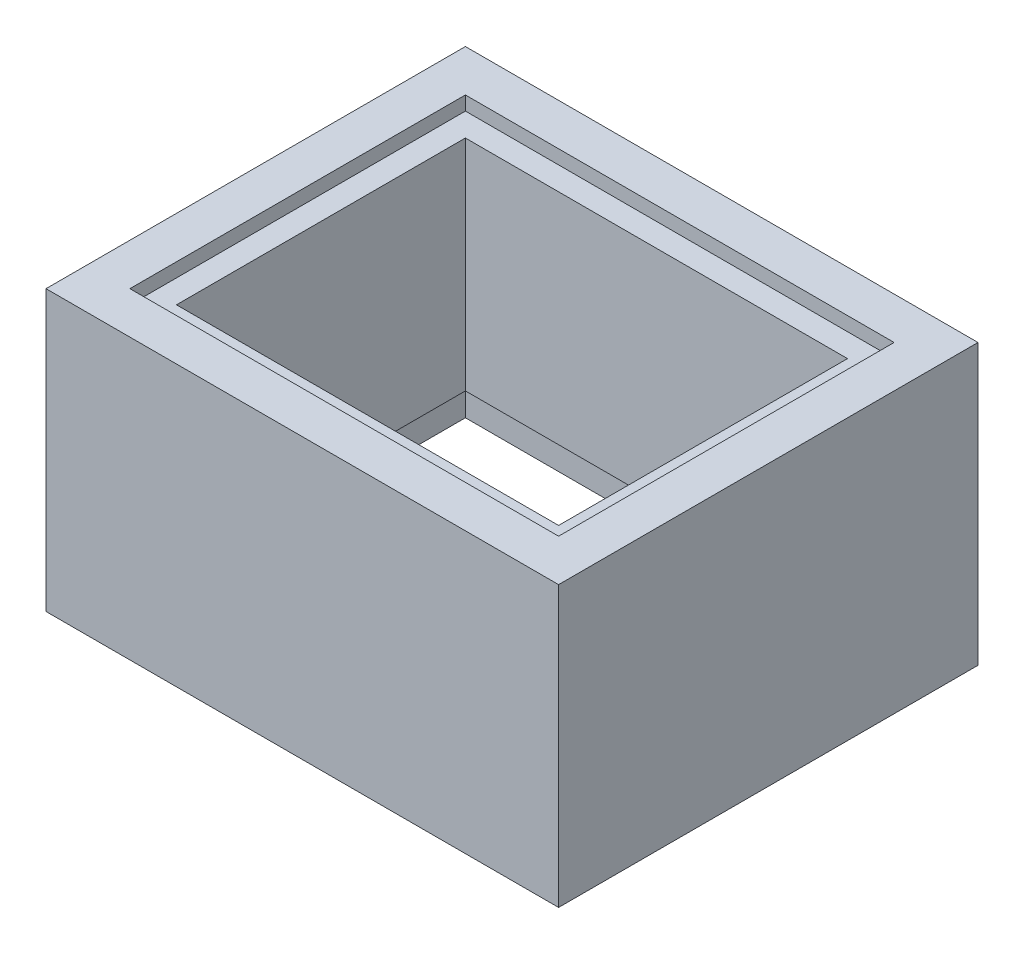
ISO-10303-21;
HEADER;
FILE_DESCRIPTION(('STEP AP214'),'2;1');
FILE_NAME('part.step','',(''),(''),'','','');
FILE_SCHEMA(('AUTOMOTIVE_DESIGN { 1 0 10303 214 1 1 1 1 }'));
ENDSEC;
DATA;
#1=APPLICATION_CONTEXT('core data for automotive mechanical design processes');
#2=APPLICATION_PROTOCOL_DEFINITION('international standard','automotive_design',2000,#1);
#3=PRODUCT_CONTEXT('',#1,'mechanical');
#4=PRODUCT('Part','Part','',(#3));
#5=PRODUCT_RELATED_PRODUCT_CATEGORY('part','',(#4));
#6=PRODUCT_DEFINITION_FORMATION('','',#4);
#7=PRODUCT_DEFINITION_CONTEXT('part definition',#1,'design');
#8=PRODUCT_DEFINITION('design','',#6,#7);
#9=PRODUCT_DEFINITION_SHAPE('','',#8);
#10=(LENGTH_UNIT() NAMED_UNIT(*) SI_UNIT(.MILLI.,.METRE.));
#11=(NAMED_UNIT(*) PLANE_ANGLE_UNIT() SI_UNIT($,.RADIAN.));
#12=(NAMED_UNIT(*) SI_UNIT($,.STERADIAN.) SOLID_ANGLE_UNIT());
#13=UNCERTAINTY_MEASURE_WITH_UNIT(LENGTH_MEASURE(1.E-05),#10,'distance_accuracy_value','');
#14=(GEOMETRIC_REPRESENTATION_CONTEXT(3) GLOBAL_UNCERTAINTY_ASSIGNED_CONTEXT((#13)) GLOBAL_UNIT_ASSIGNED_CONTEXT((#10,
#11,#12)) REPRESENTATION_CONTEXT('',''));
#15=CARTESIAN_POINT('',(0.,0.,0.));
#16=DIRECTION('',(0.,0.,1.));
#17=DIRECTION('',(1.,0.,0.));
#18=AXIS2_PLACEMENT_3D('',#15,#16,#17);
#19=CARTESIAN_POINT('',(0.,60.,0.));
#20=DIRECTION('',(1.,0.,0.));
#21=DIRECTION('',(0.,0.,-1.));
#22=AXIS2_PLACEMENT_3D('',#19,#20,#21);
#23=PLANE('',#22);
#24=DIRECTION('',(0.,0.,1.));
#25=VECTOR('',#24,1.);
#26=CARTESIAN_POINT('',(0.,0.,0.));
#27=LINE('',#26,#25);
#28=CARTESIAN_POINT('',(0.,0.,-90.));
#29=VERTEX_POINT('',#28);
#30=CARTESIAN_POINT('',(0.,0.,0.));
#31=VERTEX_POINT('',#30);
#32=EDGE_CURVE('E233',#29,#31,#27,.T.);
#33=ORIENTED_EDGE('',*,*,#32,.T.);
#34=DIRECTION('',(0.,-1.,0.));
#35=VECTOR('',#34,1.);
#36=CARTESIAN_POINT('',(0.,60.,0.));
#37=LINE('',#36,#35);
#38=CARTESIAN_POINT('',(0.,60.,0.));
#39=VERTEX_POINT('',#38);
#40=EDGE_CURVE('E266',#39,#31,#37,.T.);
#41=ORIENTED_EDGE('',*,*,#40,.F.);
#42=DIRECTION('',(0.,0.,1.));
#43=VECTOR('',#42,1.);
#44=CARTESIAN_POINT('',(0.,60.,0.));
#45=LINE('',#44,#43);
#46=CARTESIAN_POINT('',(0.,60.,-90.));
#47=VERTEX_POINT('',#46);
#48=EDGE_CURVE('E240',#47,#39,#45,.T.);
#49=ORIENTED_EDGE('',*,*,#48,.F.);
#50=DIRECTION('',(0.,-1.,0.));
#51=VECTOR('',#50,1.);
#52=CARTESIAN_POINT('',(0.,60.,-90.));
#53=LINE('',#52,#51);
#54=EDGE_CURVE('E250',#47,#29,#53,.T.);
#55=ORIENTED_EDGE('',*,*,#54,.T.);
#56=EDGE_LOOP('',(#33,#41,#49,#55));
#57=FACE_BOUND('',#56,.T.);
#58=ADVANCED_FACE('F35',(#57),#23,.F.);
#59=CARTESIAN_POINT('',(0.,60.,0.));
#60=DIRECTION('',(0.,0.,-1.));
#61=DIRECTION('',(-1.,0.,0.));
#62=AXIS2_PLACEMENT_3D('',#59,#60,#61);
#63=PLANE('',#62);
#64=DIRECTION('',(1.,0.,0.));
#65=VECTOR('',#64,1.);
#66=CARTESIAN_POINT('',(0.,0.,0.));
#67=LINE('',#66,#65);
#68=CARTESIAN_POINT('',(110.,0.,0.));
#69=VERTEX_POINT('',#68);
#70=EDGE_CURVE('E253',#31,#69,#67,.T.);
#71=ORIENTED_EDGE('',*,*,#70,.T.);
#72=DIRECTION('',(0.,-1.,0.));
#73=VECTOR('',#72,1.);
#74=CARTESIAN_POINT('',(110.,60.,0.));
#75=LINE('',#74,#73);
#76=CARTESIAN_POINT('',(110.,60.,0.));
#77=VERTEX_POINT('',#76);
#78=EDGE_CURVE('E263',#77,#69,#75,.T.);
#79=ORIENTED_EDGE('',*,*,#78,.F.);
#80=DIRECTION('',(1.,0.,0.));
#81=VECTOR('',#80,1.);
#82=CARTESIAN_POINT('',(0.,60.,0.));
#83=LINE('',#82,#81);
#84=EDGE_CURVE('E243',#39,#77,#83,.T.);
#85=ORIENTED_EDGE('',*,*,#84,.F.);
#86=ORIENTED_EDGE('',*,*,#40,.T.);
#87=EDGE_LOOP('',(#71,#79,#85,#86));
#88=FACE_BOUND('',#87,.T.);
#89=ADVANCED_FACE('F320',(#88),#63,.F.);
#90=CARTESIAN_POINT('',(110.,60.,0.));
#91=DIRECTION('',(-1.,0.,0.));
#92=DIRECTION('',(0.,0.,1.));
#93=AXIS2_PLACEMENT_3D('',#90,#91,#92);
#94=PLANE('',#93);
#95=DIRECTION('',(0.,0.,-1.));
#96=VECTOR('',#95,1.);
#97=CARTESIAN_POINT('',(110.,0.,0.));
#98=LINE('',#97,#96);
#99=CARTESIAN_POINT('',(110.,0.,-90.));
#100=VERTEX_POINT('',#99);
#101=EDGE_CURVE('E255',#69,#100,#98,.T.);
#102=ORIENTED_EDGE('',*,*,#101,.T.);
#103=DIRECTION('',(0.,-1.,0.));
#104=VECTOR('',#103,1.);
#105=CARTESIAN_POINT('',(110.,60.,-90.));
#106=LINE('',#105,#104);
#107=CARTESIAN_POINT('',(110.,60.,-90.));
#108=VERTEX_POINT('',#107);
#109=EDGE_CURVE('E260',#108,#100,#106,.T.);
#110=ORIENTED_EDGE('',*,*,#109,.F.);
#111=DIRECTION('',(0.,0.,-1.));
#112=VECTOR('',#111,1.);
#113=CARTESIAN_POINT('',(110.,60.,0.));
#114=LINE('',#113,#112);
#115=EDGE_CURVE('E246',#77,#108,#114,.T.);
#116=ORIENTED_EDGE('',*,*,#115,.F.);
#117=ORIENTED_EDGE('',*,*,#78,.T.);
#118=EDGE_LOOP('',(#102,#110,#116,#117));
#119=FACE_BOUND('',#118,.T.);
#120=ADVANCED_FACE('F317',(#119),#94,.F.);
#121=CARTESIAN_POINT('',(0.,60.,-90.));
#122=DIRECTION('',(0.,0.,1.));
#123=DIRECTION('',(1.,0.,0.));
#124=AXIS2_PLACEMENT_3D('',#121,#122,#123);
#125=PLANE('',#124);
#126=DIRECTION('',(-1.,0.,0.));
#127=VECTOR('',#126,1.);
#128=CARTESIAN_POINT('',(0.,0.,-90.));
#129=LINE('',#128,#127);
#130=EDGE_CURVE('E244',#100,#29,#129,.T.);
#131=ORIENTED_EDGE('',*,*,#130,.T.);
#132=ORIENTED_EDGE('',*,*,#54,.F.);
#133=DIRECTION('',(-1.,0.,0.));
#134=VECTOR('',#133,1.);
#135=CARTESIAN_POINT('',(0.,60.,-90.));
#136=LINE('',#135,#134);
#137=EDGE_CURVE('E248',#108,#47,#136,.T.);
#138=ORIENTED_EDGE('',*,*,#137,.F.);
#139=ORIENTED_EDGE('',*,*,#109,.T.);
#140=EDGE_LOOP('',(#131,#132,#138,#139));
#141=FACE_BOUND('',#140,.T.);
#142=ADVANCED_FACE('F313',(#141),#125,.F.);
#143=CARTESIAN_POINT('',(0.,60.,0.));
#144=DIRECTION('',(0.,-1.,0.));
#145=DIRECTION('',(0.,0.,-1.));
#146=AXIS2_PLACEMENT_3D('',#143,#144,#145);
#147=PLANE('',#146);
#148=DIRECTION('',(0.,0.,-1.));
#149=VECTOR('',#148,1.);
#150=CARTESIAN_POINT('',(101.,60.,-9.));
#151=LINE('',#150,#149);
#152=CARTESIAN_POINT('',(101.,60.,-9.));
#153=VERTEX_POINT('',#152);
#154=CARTESIAN_POINT('',(101.,60.,-81.));
#155=VERTEX_POINT('',#154);
#156=EDGE_CURVE('E223',#153,#155,#151,.T.);
#157=ORIENTED_EDGE('',*,*,#156,.F.);
#158=DIRECTION('',(1.,0.,0.));
#159=VECTOR('',#158,1.);
#160=CARTESIAN_POINT('',(9.,60.,-9.));
#161=LINE('',#160,#159);
#162=CARTESIAN_POINT('',(9.,60.,-9.));
#163=VERTEX_POINT('',#162);
#164=EDGE_CURVE('E201',#163,#153,#161,.T.);
#165=ORIENTED_EDGE('',*,*,#164,.F.);
#166=DIRECTION('',(0.,0.,1.));
#167=VECTOR('',#166,1.);
#168=CARTESIAN_POINT('',(9.,60.,-81.));
#169=LINE('',#168,#167);
#170=CARTESIAN_POINT('',(9.,60.,-81.));
#171=VERTEX_POINT('',#170);
#172=EDGE_CURVE('E212',#171,#163,#169,.T.);
#173=ORIENTED_EDGE('',*,*,#172,.F.);
#174=DIRECTION('',(-1.,0.,0.));
#175=VECTOR('',#174,1.);
#176=CARTESIAN_POINT('',(101.,60.,-81.));
#177=LINE('',#176,#175);
#178=EDGE_CURVE('E226',#155,#171,#177,.T.);
#179=ORIENTED_EDGE('',*,*,#178,.F.);
#180=EDGE_LOOP('',(#157,#165,#173,#179));
#181=FACE_BOUND('',#180,.T.);
#182=ORIENTED_EDGE('',*,*,#48,.T.);
#183=ORIENTED_EDGE('',*,*,#84,.T.);
#184=ORIENTED_EDGE('',*,*,#115,.T.);
#185=ORIENTED_EDGE('',*,*,#137,.T.);
#186=EDGE_LOOP('',(#182,#183,#184,#185));
#187=FACE_BOUND('',#186,.T.);
#188=ADVANCED_FACE('F302',(#181,#187),#147,.F.);
#189=CARTESIAN_POINT('',(0.,0.,0.));
#190=DIRECTION('',(0.,-1.,0.));
#191=DIRECTION('',(0.,0.,-1.));
#192=AXIS2_PLACEMENT_3D('',#189,#190,#191);
#193=PLANE('',#192);
#194=DIRECTION('',(0.,0.,-1.));
#195=VECTOR('',#194,1.);
#196=CARTESIAN_POINT('',(9.,0.,-9.));
#197=LINE('',#196,#195);
#198=CARTESIAN_POINT('',(9.,0.,-9.));
#199=VERTEX_POINT('',#198);
#200=CARTESIAN_POINT('',(9.,0.,-81.));
#201=VERTEX_POINT('',#200);
#202=EDGE_CURVE('E172',#199,#201,#197,.T.);
#203=ORIENTED_EDGE('',*,*,#202,.F.);
#204=DIRECTION('',(-1.,0.,0.));
#205=VECTOR('',#204,1.);
#206=CARTESIAN_POINT('',(101.,0.,-9.));
#207=LINE('',#206,#205);
#208=CARTESIAN_POINT('',(101.,0.,-9.));
#209=VERTEX_POINT('',#208);
#210=EDGE_CURVE('E180',#209,#199,#207,.T.);
#211=ORIENTED_EDGE('',*,*,#210,.F.);
#212=DIRECTION('',(0.,0.,1.));
#213=VECTOR('',#212,1.);
#214=CARTESIAN_POINT('',(101.,0.,-81.));
#215=LINE('',#214,#213);
#216=CARTESIAN_POINT('',(101.,0.,-81.));
#217=VERTEX_POINT('',#216);
#218=EDGE_CURVE('E194',#217,#209,#215,.T.);
#219=ORIENTED_EDGE('',*,*,#218,.F.);
#220=DIRECTION('',(1.,0.,0.));
#221=VECTOR('',#220,1.);
#222=CARTESIAN_POINT('',(9.,0.,-81.));
#223=LINE('',#222,#221);
#224=EDGE_CURVE('E191',#201,#217,#223,.T.);
#225=ORIENTED_EDGE('',*,*,#224,.F.);
#226=EDGE_LOOP('',(#203,#211,#219,#225));
#227=FACE_BOUND('',#226,.T.);
#228=ORIENTED_EDGE('',*,*,#32,.F.);
#229=ORIENTED_EDGE('',*,*,#130,.F.);
#230=ORIENTED_EDGE('',*,*,#101,.F.);
#231=ORIENTED_EDGE('',*,*,#70,.F.);
#232=EDGE_LOOP('',(#228,#229,#230,#231));
#233=FACE_BOUND('',#232,.T.);
#234=ADVANCED_FACE('F298',(#227,#233),#193,.T.);
#235=CARTESIAN_POINT('',(9.,57.,-9.));
#236=DIRECTION('',(0.,0.,1.));
#237=DIRECTION('',(1.,0.,0.));
#238=AXIS2_PLACEMENT_3D('',#235,#236,#237);
#239=PLANE('',#238);
#240=ORIENTED_EDGE('',*,*,#164,.T.);
#241=DIRECTION('',(0.,1.,0.));
#242=VECTOR('',#241,1.);
#243=CARTESIAN_POINT('',(101.,57.,-9.));
#244=LINE('',#243,#242);
#245=CARTESIAN_POINT('',(101.,57.,-9.));
#246=VERTEX_POINT('',#245);
#247=EDGE_CURVE('E221',#246,#153,#244,.T.);
#248=ORIENTED_EDGE('',*,*,#247,.F.);
#249=DIRECTION('',(1.,0.,0.));
#250=VECTOR('',#249,1.);
#251=CARTESIAN_POINT('',(9.,57.,-9.));
#252=LINE('',#251,#250);
#253=CARTESIAN_POINT('',(9.,57.,-9.));
#254=VERTEX_POINT('',#253);
#255=EDGE_CURVE('E208',#254,#246,#252,.T.);
#256=ORIENTED_EDGE('',*,*,#255,.F.);
#257=DIRECTION('',(0.,1.,0.));
#258=VECTOR('',#257,1.);
#259=CARTESIAN_POINT('',(9.,57.,-9.));
#260=LINE('',#259,#258);
#261=EDGE_CURVE('E231',#254,#163,#260,.T.);
#262=ORIENTED_EDGE('',*,*,#261,.T.);
#263=EDGE_LOOP('',(#240,#248,#256,#262));
#264=FACE_BOUND('',#263,.T.);
#265=ADVANCED_FACE('F301',(#264),#239,.F.);
#266=CARTESIAN_POINT('',(9.,57.,-81.));
#267=DIRECTION('',(-1.,0.,0.));
#268=DIRECTION('',(0.,0.,1.));
#269=AXIS2_PLACEMENT_3D('',#266,#267,#268);
#270=PLANE('',#269);
#271=ORIENTED_EDGE('',*,*,#172,.T.);
#272=ORIENTED_EDGE('',*,*,#261,.F.);
#273=DIRECTION('',(0.,0.,1.));
#274=VECTOR('',#273,1.);
#275=CARTESIAN_POINT('',(9.,57.,-81.));
#276=LINE('',#275,#274);
#277=CARTESIAN_POINT('',(9.,57.,-81.));
#278=VERTEX_POINT('',#277);
#279=EDGE_CURVE('E218',#278,#254,#276,.T.);
#280=ORIENTED_EDGE('',*,*,#279,.F.);
#281=DIRECTION('',(0.,1.,0.));
#282=VECTOR('',#281,1.);
#283=CARTESIAN_POINT('',(9.,57.,-81.));
#284=LINE('',#283,#282);
#285=EDGE_CURVE('E234',#278,#171,#284,.T.);
#286=ORIENTED_EDGE('',*,*,#285,.T.);
#287=EDGE_LOOP('',(#271,#272,#280,#286));
#288=FACE_BOUND('',#287,.T.);
#289=ADVANCED_FACE('F359',(#288),#270,.F.);
#290=CARTESIAN_POINT('',(101.,57.,-81.));
#291=DIRECTION('',(0.,0.,-1.));
#292=DIRECTION('',(-1.,0.,0.));
#293=AXIS2_PLACEMENT_3D('',#290,#291,#292);
#294=PLANE('',#293);
#295=ORIENTED_EDGE('',*,*,#178,.T.);
#296=ORIENTED_EDGE('',*,*,#285,.F.);
#297=DIRECTION('',(-1.,0.,0.));
#298=VECTOR('',#297,1.);
#299=CARTESIAN_POINT('',(101.,57.,-81.));
#300=LINE('',#299,#298);
#301=CARTESIAN_POINT('',(101.,57.,-81.));
#302=VERTEX_POINT('',#301);
#303=EDGE_CURVE('E215',#302,#278,#300,.T.);
#304=ORIENTED_EDGE('',*,*,#303,.F.);
#305=DIRECTION('',(0.,1.,0.));
#306=VECTOR('',#305,1.);
#307=CARTESIAN_POINT('',(101.,57.,-81.));
#308=LINE('',#307,#306);
#309=EDGE_CURVE('E236',#302,#155,#308,.T.);
#310=ORIENTED_EDGE('',*,*,#309,.T.);
#311=EDGE_LOOP('',(#295,#296,#304,#310));
#312=FACE_BOUND('',#311,.T.);
#313=ADVANCED_FACE('F368',(#312),#294,.F.);
#314=CARTESIAN_POINT('',(101.,57.,-9.));
#315=DIRECTION('',(1.,0.,0.));
#316=DIRECTION('',(0.,0.,-1.));
#317=AXIS2_PLACEMENT_3D('',#314,#315,#316);
#318=PLANE('',#317);
#319=ORIENTED_EDGE('',*,*,#156,.T.);
#320=ORIENTED_EDGE('',*,*,#309,.F.);
#321=DIRECTION('',(0.,0.,-1.));
#322=VECTOR('',#321,1.);
#323=CARTESIAN_POINT('',(101.,57.,-9.));
#324=LINE('',#323,#322);
#325=EDGE_CURVE('E211',#246,#302,#324,.T.);
#326=ORIENTED_EDGE('',*,*,#325,.F.);
#327=ORIENTED_EDGE('',*,*,#247,.T.);
#328=EDGE_LOOP('',(#319,#320,#326,#327));
#329=FACE_BOUND('',#328,.T.);
#330=ADVANCED_FACE('F378',(#329),#318,.F.);
#331=CARTESIAN_POINT('',(0.,57.,0.));
#332=DIRECTION('',(0.,1.,0.));
#333=DIRECTION('',(0.,0.,1.));
#334=AXIS2_PLACEMENT_3D('',#331,#332,#333);
#335=PLANE('',#334);
#336=DIRECTION('',(0.,0.,1.));
#337=VECTOR('',#336,1.);
#338=CARTESIAN_POINT('',(14.,57.,-76.));
#339=LINE('',#338,#337);
#340=CARTESIAN_POINT('',(14.,57.,-76.));
#341=VERTEX_POINT('',#340);
#342=CARTESIAN_POINT('',(14.,57.,-14.));
#343=VERTEX_POINT('',#342);
#344=EDGE_CURVE('E157',#341,#343,#339,.T.);
#345=ORIENTED_EDGE('',*,*,#344,.F.);
#346=DIRECTION('',(-1.,0.,0.));
#347=VECTOR('',#346,1.);
#348=CARTESIAN_POINT('',(96.,57.,-76.));
#349=LINE('',#348,#347);
#350=CARTESIAN_POINT('',(96.,57.,-76.));
#351=VERTEX_POINT('',#350);
#352=EDGE_CURVE('E154',#351,#341,#349,.T.);
#353=ORIENTED_EDGE('',*,*,#352,.F.);
#354=DIRECTION('',(0.,0.,-1.));
#355=VECTOR('',#354,1.);
#356=CARTESIAN_POINT('',(96.,57.,-14.));
#357=LINE('',#356,#355);
#358=CARTESIAN_POINT('',(96.,57.,-14.));
#359=VERTEX_POINT('',#358);
#360=EDGE_CURVE('E49',#359,#351,#357,.T.);
#361=ORIENTED_EDGE('',*,*,#360,.F.);
#362=DIRECTION('',(1.,0.,0.));
#363=VECTOR('',#362,1.);
#364=CARTESIAN_POINT('',(14.,57.,-14.));
#365=LINE('',#364,#363);
#366=EDGE_CURVE('E149',#343,#359,#365,.T.);
#367=ORIENTED_EDGE('',*,*,#366,.F.);
#368=EDGE_LOOP('',(#345,#353,#361,#367));
#369=FACE_BOUND('',#368,.T.);
#370=ORIENTED_EDGE('',*,*,#255,.T.);
#371=ORIENTED_EDGE('',*,*,#325,.T.);
#372=ORIENTED_EDGE('',*,*,#303,.T.);
#373=ORIENTED_EDGE('',*,*,#279,.T.);
#374=EDGE_LOOP('',(#370,#371,#372,#373));
#375=FACE_BOUND('',#374,.T.);
#376=ADVANCED_FACE('F165',(#369,#375),#335,.T.);
#377=CARTESIAN_POINT('',(9.,10.,-9.));
#378=DIRECTION('',(-1.,0.,0.));
#379=DIRECTION('',(0.,0.,1.));
#380=AXIS2_PLACEMENT_3D('',#377,#378,#379);
#381=PLANE('',#380);
#382=ORIENTED_EDGE('',*,*,#202,.T.);
#383=DIRECTION('',(0.,-1.,0.));
#384=VECTOR('',#383,1.);
#385=CARTESIAN_POINT('',(9.,10.,-81.));
#386=LINE('',#385,#384);
#387=CARTESIAN_POINT('',(9.,10.,-81.));
#388=VERTEX_POINT('',#387);
#389=EDGE_CURVE('E189',#388,#201,#386,.T.);
#390=ORIENTED_EDGE('',*,*,#389,.F.);
#391=DIRECTION('',(0.,0.,-1.));
#392=VECTOR('',#391,1.);
#393=CARTESIAN_POINT('',(9.,10.,-9.));
#394=LINE('',#393,#392);
#395=CARTESIAN_POINT('',(9.,10.,-9.));
#396=VERTEX_POINT('',#395);
#397=EDGE_CURVE('E176',#396,#388,#394,.T.);
#398=ORIENTED_EDGE('',*,*,#397,.F.);
#399=DIRECTION('',(0.,-1.,0.));
#400=VECTOR('',#399,1.);
#401=CARTESIAN_POINT('',(9.,10.,-9.));
#402=LINE('',#401,#400);
#403=EDGE_CURVE('E199',#396,#199,#402,.T.);
#404=ORIENTED_EDGE('',*,*,#403,.T.);
#405=EDGE_LOOP('',(#382,#390,#398,#404));
#406=FACE_BOUND('',#405,.T.);
#407=ADVANCED_FACE('F286',(#406),#381,.F.);
#408=CARTESIAN_POINT('',(101.,10.,-9.));
#409=DIRECTION('',(0.,0.,1.));
#410=DIRECTION('',(1.,0.,0.));
#411=AXIS2_PLACEMENT_3D('',#408,#409,#410);
#412=PLANE('',#411);
#413=ORIENTED_EDGE('',*,*,#210,.T.);
#414=ORIENTED_EDGE('',*,*,#403,.F.);
#415=DIRECTION('',(-1.,0.,0.));
#416=VECTOR('',#415,1.);
#417=CARTESIAN_POINT('',(101.,10.,-9.));
#418=LINE('',#417,#416);
#419=CARTESIAN_POINT('',(101.,10.,-9.));
#420=VERTEX_POINT('',#419);
#421=EDGE_CURVE('E186',#420,#396,#418,.T.);
#422=ORIENTED_EDGE('',*,*,#421,.F.);
#423=DIRECTION('',(0.,-1.,0.));
#424=VECTOR('',#423,1.);
#425=CARTESIAN_POINT('',(101.,10.,-9.));
#426=LINE('',#425,#424);
#427=EDGE_CURVE('E202',#420,#209,#426,.T.);
#428=ORIENTED_EDGE('',*,*,#427,.T.);
#429=EDGE_LOOP('',(#413,#414,#422,#428));
#430=FACE_BOUND('',#429,.T.);
#431=ADVANCED_FACE('F295',(#430),#412,.F.);
#432=CARTESIAN_POINT('',(101.,10.,-81.));
#433=DIRECTION('',(1.,0.,0.));
#434=DIRECTION('',(0.,0.,-1.));
#435=AXIS2_PLACEMENT_3D('',#432,#433,#434);
#436=PLANE('',#435);
#437=ORIENTED_EDGE('',*,*,#218,.T.);
#438=ORIENTED_EDGE('',*,*,#427,.F.);
#439=DIRECTION('',(0.,0.,1.));
#440=VECTOR('',#439,1.);
#441=CARTESIAN_POINT('',(101.,10.,-81.));
#442=LINE('',#441,#440);
#443=CARTESIAN_POINT('',(101.,10.,-81.));
#444=VERTEX_POINT('',#443);
#445=EDGE_CURVE('E183',#444,#420,#442,.T.);
#446=ORIENTED_EDGE('',*,*,#445,.F.);
#447=DIRECTION('',(0.,-1.,0.));
#448=VECTOR('',#447,1.);
#449=CARTESIAN_POINT('',(101.,10.,-81.));
#450=LINE('',#449,#448);
#451=EDGE_CURVE('E204',#444,#217,#450,.T.);
#452=ORIENTED_EDGE('',*,*,#451,.T.);
#453=EDGE_LOOP('',(#437,#438,#446,#452));
#454=FACE_BOUND('',#453,.T.);
#455=ADVANCED_FACE('F293',(#454),#436,.F.);
#456=CARTESIAN_POINT('',(9.,10.,-81.));
#457=DIRECTION('',(0.,0.,-1.));
#458=DIRECTION('',(-1.,0.,0.));
#459=AXIS2_PLACEMENT_3D('',#456,#457,#458);
#460=PLANE('',#459);
#461=ORIENTED_EDGE('',*,*,#224,.T.);
#462=ORIENTED_EDGE('',*,*,#451,.F.);
#463=DIRECTION('',(1.,0.,0.));
#464=VECTOR('',#463,1.);
#465=CARTESIAN_POINT('',(9.,10.,-81.));
#466=LINE('',#465,#464);
#467=EDGE_CURVE('E179',#388,#444,#466,.T.);
#468=ORIENTED_EDGE('',*,*,#467,.F.);
#469=ORIENTED_EDGE('',*,*,#389,.T.);
#470=EDGE_LOOP('',(#461,#462,#468,#469));
#471=FACE_BOUND('',#470,.T.);
#472=ADVANCED_FACE('F280',(#471),#460,.F.);
#473=CARTESIAN_POINT('',(0.,10.,0.));
#474=DIRECTION('',(0.,-1.,0.));
#475=DIRECTION('',(0.,0.,-1.));
#476=AXIS2_PLACEMENT_3D('',#473,#474,#475);
#477=PLANE('',#476);
#478=DIRECTION('',(0.,0.,-1.));
#479=VECTOR('',#478,1.);
#480=CARTESIAN_POINT('',(14.,10.,0.));
#481=LINE('',#480,#479);
#482=CARTESIAN_POINT('',(14.,10.,-14.));
#483=VERTEX_POINT('',#482);
#484=CARTESIAN_POINT('',(14.,10.,-76.));
#485=VERTEX_POINT('',#484);
#486=EDGE_CURVE('E11',#483,#485,#481,.T.);
#487=ORIENTED_EDGE('',*,*,#486,.F.);
#488=DIRECTION('',(-1.,0.,0.));
#489=VECTOR('',#488,1.);
#490=CARTESIAN_POINT('',(0.,10.,-14.));
#491=LINE('',#490,#489);
#492=CARTESIAN_POINT('',(96.,10.,-14.));
#493=VERTEX_POINT('',#492);
#494=EDGE_CURVE('E151',#493,#483,#491,.T.);
#495=ORIENTED_EDGE('',*,*,#494,.F.);
#496=DIRECTION('',(0.,0.,1.));
#497=VECTOR('',#496,1.);
#498=CARTESIAN_POINT('',(96.,10.,0.));
#499=LINE('',#498,#497);
#500=CARTESIAN_POINT('',(96.,10.,-76.));
#501=VERTEX_POINT('',#500);
#502=EDGE_CURVE('E270',#501,#493,#499,.T.);
#503=ORIENTED_EDGE('',*,*,#502,.F.);
#504=DIRECTION('',(1.,0.,0.));
#505=VECTOR('',#504,1.);
#506=CARTESIAN_POINT('',(0.,10.,-76.));
#507=LINE('',#506,#505);
#508=EDGE_CURVE('E42',#485,#501,#507,.T.);
#509=ORIENTED_EDGE('',*,*,#508,.F.);
#510=EDGE_LOOP('',(#487,#495,#503,#509));
#511=FACE_BOUND('',#510,.T.);
#512=ORIENTED_EDGE('',*,*,#397,.T.);
#513=ORIENTED_EDGE('',*,*,#467,.T.);
#514=ORIENTED_EDGE('',*,*,#445,.T.);
#515=ORIENTED_EDGE('',*,*,#421,.T.);
#516=EDGE_LOOP('',(#512,#513,#514,#515));
#517=FACE_BOUND('',#516,.T.);
#518=ADVANCED_FACE('F277',(#511,#517),#477,.T.);
#519=CARTESIAN_POINT('',(14.,-3.,-76.));
#520=DIRECTION('',(-1.,0.,0.));
#521=DIRECTION('',(0.,0.,1.));
#522=AXIS2_PLACEMENT_3D('',#519,#520,#521);
#523=PLANE('',#522);
#524=ORIENTED_EDGE('',*,*,#486,.T.);
#525=DIRECTION('',(0.,1.,0.));
#526=VECTOR('',#525,1.);
#527=CARTESIAN_POINT('',(14.,-3.,-76.));
#528=LINE('',#527,#526);
#529=EDGE_CURVE('E160',#485,#341,#528,.T.);
#530=ORIENTED_EDGE('',*,*,#529,.T.);
#531=ORIENTED_EDGE('',*,*,#344,.T.);
#532=DIRECTION('',(0.,1.,0.));
#533=VECTOR('',#532,1.);
#534=CARTESIAN_POINT('',(14.,-3.,-14.));
#535=LINE('',#534,#533);
#536=EDGE_CURVE('E145',#483,#343,#535,.T.);
#537=ORIENTED_EDGE('',*,*,#536,.F.);
#538=EDGE_LOOP('',(#524,#530,#531,#537));
#539=FACE_BOUND('',#538,.T.);
#540=ADVANCED_FACE('F158',(#539),#523,.F.);
#541=CARTESIAN_POINT('',(96.,-3.,-76.));
#542=DIRECTION('',(0.,0.,-1.));
#543=DIRECTION('',(-1.,0.,0.));
#544=AXIS2_PLACEMENT_3D('',#541,#542,#543);
#545=PLANE('',#544);
#546=ORIENTED_EDGE('',*,*,#508,.T.);
#547=DIRECTION('',(0.,1.,0.));
#548=VECTOR('',#547,1.);
#549=CARTESIAN_POINT('',(96.,-3.,-76.));
#550=LINE('',#549,#548);
#551=EDGE_CURVE('E173',#501,#351,#550,.T.);
#552=ORIENTED_EDGE('',*,*,#551,.T.);
#553=ORIENTED_EDGE('',*,*,#352,.T.);
#554=ORIENTED_EDGE('',*,*,#529,.F.);
#555=EDGE_LOOP('',(#546,#552,#553,#554));
#556=FACE_BOUND('',#555,.T.);
#557=ADVANCED_FACE('F273',(#556),#545,.F.);
#558=CARTESIAN_POINT('',(96.,-3.,-14.));
#559=DIRECTION('',(1.,0.,0.));
#560=DIRECTION('',(0.,0.,-1.));
#561=AXIS2_PLACEMENT_3D('',#558,#559,#560);
#562=PLANE('',#561);
#563=ORIENTED_EDGE('',*,*,#502,.T.);
#564=DIRECTION('',(0.,1.,0.));
#565=VECTOR('',#564,1.);
#566=CARTESIAN_POINT('',(96.,-3.,-14.));
#567=LINE('',#566,#565);
#568=EDGE_CURVE('E56',#493,#359,#567,.T.);
#569=ORIENTED_EDGE('',*,*,#568,.T.);
#570=ORIENTED_EDGE('',*,*,#360,.T.);
#571=ORIENTED_EDGE('',*,*,#551,.F.);
#572=EDGE_LOOP('',(#563,#569,#570,#571));
#573=FACE_BOUND('',#572,.T.);
#574=ADVANCED_FACE('F276',(#573),#562,.F.);
#575=CARTESIAN_POINT('',(14.,-3.,-14.));
#576=DIRECTION('',(0.,0.,1.));
#577=DIRECTION('',(1.,0.,0.));
#578=AXIS2_PLACEMENT_3D('',#575,#576,#577);
#579=PLANE('',#578);
#580=ORIENTED_EDGE('',*,*,#494,.T.);
#581=ORIENTED_EDGE('',*,*,#536,.T.);
#582=ORIENTED_EDGE('',*,*,#366,.T.);
#583=ORIENTED_EDGE('',*,*,#568,.F.);
#584=EDGE_LOOP('',(#580,#581,#582,#583));
#585=FACE_BOUND('',#584,.T.);
#586=ADVANCED_FACE('F147',(#585),#579,.F.);
#587=CLOSED_SHELL('',(#58,#89,#120,#142,#188,#234,#265,#289,#313,#330,#376,#407,#431,#455,#472,
#518,#540,#557,#574,#586));
#588=MANIFOLD_SOLID_BREP('B2',#587);
#589=ADVANCED_BREP_SHAPE_REPRESENTATION('',(#18,#588),#14);
#590=SHAPE_DEFINITION_REPRESENTATION(#9,#589);
ENDSEC;
END-ISO-10303-21;
